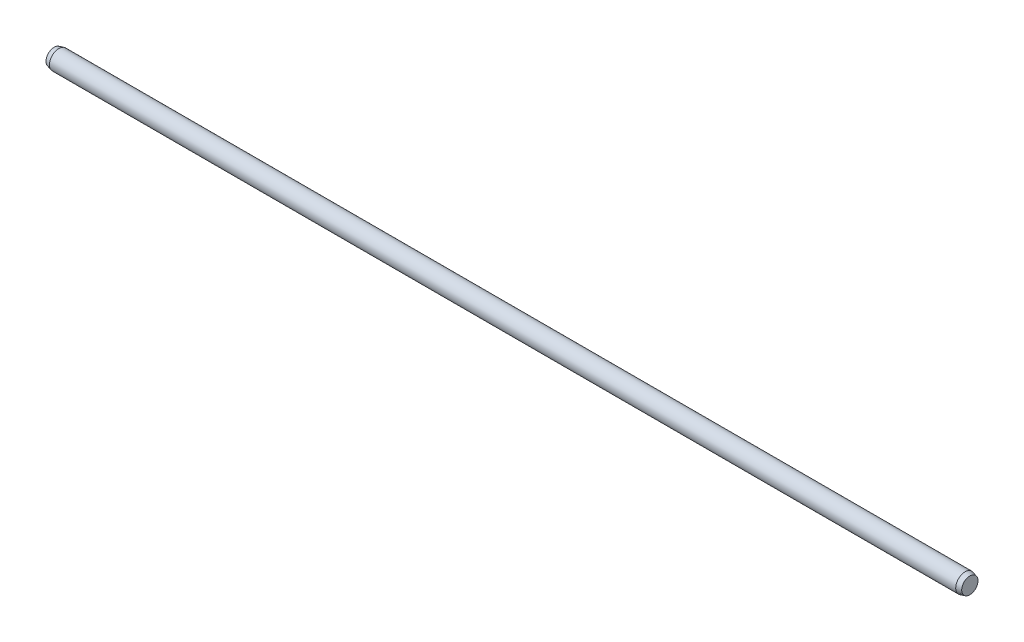
ISO-10303-21;
HEADER;
FILE_DESCRIPTION(('STEP AP214'),'2;1');
FILE_NAME('part.step','',(''),(''),'','','');
FILE_SCHEMA(('AUTOMOTIVE_DESIGN { 1 0 10303 214 1 1 1 1 }'));
ENDSEC;
DATA;
#1=APPLICATION_CONTEXT('core data for automotive mechanical design processes');
#2=APPLICATION_PROTOCOL_DEFINITION('international standard','automotive_design',2000,#1);
#3=PRODUCT_CONTEXT('',#1,'mechanical');
#4=PRODUCT('Part','Part','',(#3));
#5=PRODUCT_RELATED_PRODUCT_CATEGORY('part','',(#4));
#6=PRODUCT_DEFINITION_FORMATION('','',#4);
#7=PRODUCT_DEFINITION_CONTEXT('part definition',#1,'design');
#8=PRODUCT_DEFINITION('design','',#6,#7);
#9=PRODUCT_DEFINITION_SHAPE('','',#8);
#10=(LENGTH_UNIT() NAMED_UNIT(*) SI_UNIT(.MILLI.,.METRE.));
#11=(NAMED_UNIT(*) PLANE_ANGLE_UNIT() SI_UNIT($,.RADIAN.));
#12=(NAMED_UNIT(*) SI_UNIT($,.STERADIAN.) SOLID_ANGLE_UNIT());
#13=UNCERTAINTY_MEASURE_WITH_UNIT(LENGTH_MEASURE(1.E-05),#10,'distance_accuracy_value','');
#14=(GEOMETRIC_REPRESENTATION_CONTEXT(3) GLOBAL_UNCERTAINTY_ASSIGNED_CONTEXT((#13)) GLOBAL_UNIT_ASSIGNED_CONTEXT((#10,
#11,#12)) REPRESENTATION_CONTEXT('',''));
#15=CARTESIAN_POINT('',(0.,0.,0.));
#16=DIRECTION('',(0.,0.,1.));
#17=DIRECTION('',(1.,0.,0.));
#18=AXIS2_PLACEMENT_3D('',#15,#16,#17);
#19=CARTESIAN_POINT('',(194.5,0.,0.));
#20=DIRECTION('',(-1.,0.,0.));
#21=DIRECTION('',(0.,0.,1.));
#22=AXIS2_PLACEMENT_3D('',#19,#20,#21);
#23=CYLINDRICAL_SURFACE('',#22,4.);
#24=CARTESIAN_POINT('',(-192.5,0.,0.));
#25=DIRECTION('',(1.,0.,0.));
#26=DIRECTION('',(0.,0.,-1.));
#27=AXIS2_PLACEMENT_3D('',#24,#25,#26);
#28=CIRCLE('',#27,4.);
#29=CARTESIAN_POINT('',(-192.5,0.,-4.));
#30=VERTEX_POINT('',#29);
#31=EDGE_CURVE('E51',#30,#30,#28,.T.);
#32=ORIENTED_EDGE('',*,*,#31,.T.);
#33=EDGE_LOOP('',(#32));
#34=FACE_BOUND('',#33,.T.);
#35=CARTESIAN_POINT('',(192.5,0.,0.));
#36=DIRECTION('',(1.,0.,0.));
#37=DIRECTION('',(0.,0.,-1.));
#38=AXIS2_PLACEMENT_3D('',#35,#36,#37);
#39=CIRCLE('',#38,4.);
#40=CARTESIAN_POINT('',(192.5,0.,-4.));
#41=VERTEX_POINT('',#40);
#42=EDGE_CURVE('E55',#41,#41,#39,.F.);
#43=ORIENTED_EDGE('',*,*,#42,.T.);
#44=EDGE_LOOP('',(#43));
#45=FACE_BOUND('',#44,.T.);
#46=ADVANCED_FACE('F44',(#34,#45),#23,.T.);
#47=CARTESIAN_POINT('',(194.5,0.,0.));
#48=DIRECTION('',(1.,0.,0.));
#49=DIRECTION('',(0.,0.,-1.));
#50=AXIS2_PLACEMENT_3D('',#47,#48,#49);
#51=PLANE('',#50);
#52=CARTESIAN_POINT('',(194.5,0.,0.));
#53=DIRECTION('',(1.,0.,0.));
#54=DIRECTION('',(0.,0.,-1.));
#55=AXIS2_PLACEMENT_3D('',#52,#53,#54);
#56=CIRCLE('',#55,3.46410161513766);
#57=CARTESIAN_POINT('',(194.5,0.,-3.46410161513766));
#58=VERTEX_POINT('',#57);
#59=EDGE_CURVE('E59',#58,#58,#56,.T.);
#60=ORIENTED_EDGE('',*,*,#59,.T.);
#61=EDGE_LOOP('',(#60));
#62=FACE_BOUND('',#61,.T.);
#63=ADVANCED_FACE('F65',(#62),#51,.T.);
#64=CARTESIAN_POINT('',(-194.5,0.,0.));
#65=DIRECTION('',(1.,0.,0.));
#66=DIRECTION('',(0.,0.,-1.));
#67=AXIS2_PLACEMENT_3D('',#64,#65,#66);
#68=PLANE('',#67);
#69=CARTESIAN_POINT('',(-194.5,0.,0.));
#70=DIRECTION('',(1.,0.,0.));
#71=DIRECTION('',(0.,0.,-1.));
#72=AXIS2_PLACEMENT_3D('',#69,#70,#71);
#73=CIRCLE('',#72,3.46410161513774);
#74=CARTESIAN_POINT('',(-194.5,0.,-3.46410161513774));
#75=VERTEX_POINT('',#74);
#76=EDGE_CURVE('E12',#75,#75,#73,.F.);
#77=ORIENTED_EDGE('',*,*,#76,.T.);
#78=EDGE_LOOP('',(#77));
#79=FACE_BOUND('',#78,.T.);
#80=ADVANCED_FACE('F69',(#79),#68,.F.);
#81=CARTESIAN_POINT('',(194.5,0.,0.));
#82=DIRECTION('',(-1.,0.,0.));
#83=DIRECTION('',(0.,0.,1.));
#84=AXIS2_PLACEMENT_3D('',#81,#82,#83);
#85=CONICAL_SURFACE('',#84,3.46410161513766,0.261799387799148);
#86=ORIENTED_EDGE('',*,*,#42,.F.);
#87=EDGE_LOOP('',(#86));
#88=FACE_BOUND('',#87,.T.);
#89=ORIENTED_EDGE('',*,*,#59,.F.);
#90=EDGE_LOOP('',(#89));
#91=FACE_BOUND('',#90,.T.);
#92=ADVANCED_FACE('F67',(#88,#91),#85,.T.);
#93=CARTESIAN_POINT('',(-192.5,0.,0.));
#94=DIRECTION('',(1.,0.,0.));
#95=DIRECTION('',(0.,0.,-1.));
#96=AXIS2_PLACEMENT_3D('',#93,#94,#95);
#97=CONICAL_SURFACE('',#96,4.,0.261799387799141);
#98=ORIENTED_EDGE('',*,*,#76,.F.);
#99=EDGE_LOOP('',(#98));
#100=FACE_BOUND('',#99,.T.);
#101=ORIENTED_EDGE('',*,*,#31,.F.);
#102=EDGE_LOOP('',(#101));
#103=FACE_BOUND('',#102,.T.);
#104=ADVANCED_FACE('F46',(#100,#103),#97,.T.);
#105=CLOSED_SHELL('',(#46,#63,#80,#92,#104));
#106=MANIFOLD_SOLID_BREP('B2',#105);
#107=ADVANCED_BREP_SHAPE_REPRESENTATION('',(#18,#106),#14);
#108=SHAPE_DEFINITION_REPRESENTATION(#9,#107);
ENDSEC;
END-ISO-10303-21;
